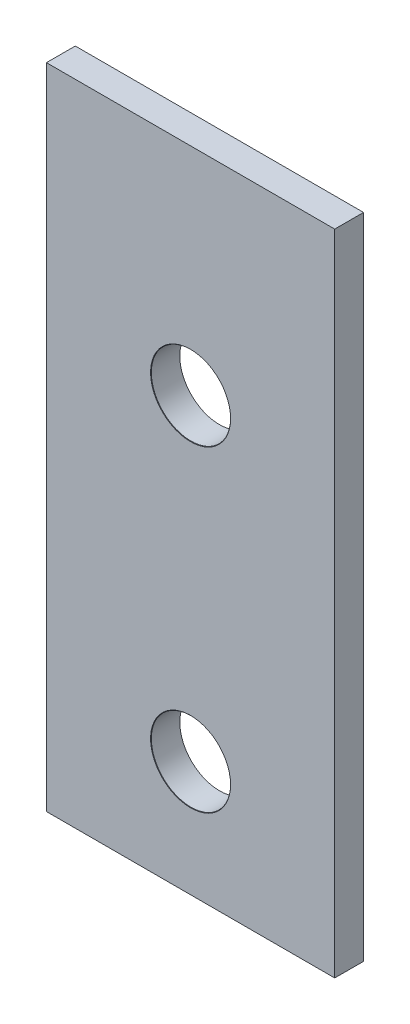
ISO-10303-21;
HEADER;
FILE_DESCRIPTION(('STEP AP214'),'2;1');
FILE_NAME('part.step','',(''),(''),'','','');
FILE_SCHEMA(('AUTOMOTIVE_DESIGN { 1 0 10303 214 1 1 1 1 }'));
ENDSEC;
DATA;
#1=APPLICATION_CONTEXT('core data for automotive mechanical design processes');
#2=APPLICATION_PROTOCOL_DEFINITION('international standard','automotive_design',2000,#1);
#3=PRODUCT_CONTEXT('',#1,'mechanical');
#4=PRODUCT('Part','Part','',(#3));
#5=PRODUCT_RELATED_PRODUCT_CATEGORY('part','',(#4));
#6=PRODUCT_DEFINITION_FORMATION('','',#4);
#7=PRODUCT_DEFINITION_CONTEXT('part definition',#1,'design');
#8=PRODUCT_DEFINITION('design','',#6,#7);
#9=PRODUCT_DEFINITION_SHAPE('','',#8);
#10=(LENGTH_UNIT() NAMED_UNIT(*) SI_UNIT(.MILLI.,.METRE.));
#11=(NAMED_UNIT(*) PLANE_ANGLE_UNIT() SI_UNIT($,.RADIAN.));
#12=(NAMED_UNIT(*) SI_UNIT($,.STERADIAN.) SOLID_ANGLE_UNIT());
#13=UNCERTAINTY_MEASURE_WITH_UNIT(LENGTH_MEASURE(1.E-05),#10,'distance_accuracy_value','');
#14=(GEOMETRIC_REPRESENTATION_CONTEXT(3) GLOBAL_UNCERTAINTY_ASSIGNED_CONTEXT((#13)) GLOBAL_UNIT_ASSIGNED_CONTEXT((#10,
#11,#12)) REPRESENTATION_CONTEXT('',''));
#15=CARTESIAN_POINT('',(0.,0.,0.));
#16=DIRECTION('',(0.,0.,1.));
#17=DIRECTION('',(1.,0.,0.));
#18=AXIS2_PLACEMENT_3D('',#15,#16,#17);
#19=CARTESIAN_POINT('',(0.,0.,2.));
#20=DIRECTION('',(1.,0.,0.));
#21=DIRECTION('',(0.,0.,-1.));
#22=AXIS2_PLACEMENT_3D('',#19,#20,#21);
#23=PLANE('',#22);
#24=DIRECTION('',(0.,-1.,0.));
#25=VECTOR('',#24,1.);
#26=CARTESIAN_POINT('',(0.,0.,0.));
#27=LINE('',#26,#25);
#28=CARTESIAN_POINT('',(0.,45.,0.));
#29=VERTEX_POINT('',#28);
#30=CARTESIAN_POINT('',(0.,0.,0.));
#31=VERTEX_POINT('',#30);
#32=EDGE_CURVE('E97',#29,#31,#27,.T.);
#33=ORIENTED_EDGE('',*,*,#32,.T.);
#34=DIRECTION('',(0.,0.,-1.));
#35=VECTOR('',#34,1.);
#36=CARTESIAN_POINT('',(0.,0.,2.));
#37=LINE('',#36,#35);
#38=CARTESIAN_POINT('',(0.,0.,2.));
#39=VERTEX_POINT('',#38);
#40=EDGE_CURVE('E11',#39,#31,#37,.T.);
#41=ORIENTED_EDGE('',*,*,#40,.F.);
#42=DIRECTION('',(0.,-1.,0.));
#43=VECTOR('',#42,1.);
#44=CARTESIAN_POINT('',(0.,0.,2.));
#45=LINE('',#44,#43);
#46=CARTESIAN_POINT('',(0.,45.,2.));
#47=VERTEX_POINT('',#46);
#48=EDGE_CURVE('E85',#47,#39,#45,.T.);
#49=ORIENTED_EDGE('',*,*,#48,.F.);
#50=DIRECTION('',(0.,0.,-1.));
#51=VECTOR('',#50,1.);
#52=CARTESIAN_POINT('',(0.,45.,2.));
#53=LINE('',#52,#51);
#54=EDGE_CURVE('E93',#47,#29,#53,.T.);
#55=ORIENTED_EDGE('',*,*,#54,.T.);
#56=EDGE_LOOP('',(#33,#41,#49,#55));
#57=FACE_BOUND('',#56,.T.);
#58=ADVANCED_FACE('F34',(#57),#23,.F.);
#59=CARTESIAN_POINT('',(0.,0.,2.));
#60=DIRECTION('',(0.,1.,0.));
#61=DIRECTION('',(0.,0.,1.));
#62=AXIS2_PLACEMENT_3D('',#59,#60,#61);
#63=PLANE('',#62);
#64=DIRECTION('',(1.,0.,0.));
#65=VECTOR('',#64,1.);
#66=CARTESIAN_POINT('',(0.,0.,0.));
#67=LINE('',#66,#65);
#68=CARTESIAN_POINT('',(20.,0.,0.));
#69=VERTEX_POINT('',#68);
#70=EDGE_CURVE('E89',#31,#69,#67,.T.);
#71=ORIENTED_EDGE('',*,*,#70,.T.);
#72=DIRECTION('',(0.,0.,-1.));
#73=VECTOR('',#72,1.);
#74=CARTESIAN_POINT('',(20.,0.,2.));
#75=LINE('',#74,#73);
#76=CARTESIAN_POINT('',(20.,0.,2.));
#77=VERTEX_POINT('',#76);
#78=EDGE_CURVE('E42',#77,#69,#75,.T.);
#79=ORIENTED_EDGE('',*,*,#78,.F.);
#80=DIRECTION('',(1.,0.,0.));
#81=VECTOR('',#80,1.);
#82=CARTESIAN_POINT('',(0.,0.,2.));
#83=LINE('',#82,#81);
#84=EDGE_CURVE('E80',#39,#77,#83,.T.);
#85=ORIENTED_EDGE('',*,*,#84,.F.);
#86=ORIENTED_EDGE('',*,*,#40,.T.);
#87=EDGE_LOOP('',(#71,#79,#85,#86));
#88=FACE_BOUND('',#87,.T.);
#89=ADVANCED_FACE('F88',(#88),#63,.F.);
#90=CARTESIAN_POINT('',(20.,0.,2.));
#91=DIRECTION('',(-1.,0.,0.));
#92=DIRECTION('',(0.,0.,1.));
#93=AXIS2_PLACEMENT_3D('',#90,#91,#92);
#94=PLANE('',#93);
#95=DIRECTION('',(0.,1.,0.));
#96=VECTOR('',#95,1.);
#97=CARTESIAN_POINT('',(20.,0.,0.));
#98=LINE('',#97,#96);
#99=CARTESIAN_POINT('',(20.,45.,0.));
#100=VERTEX_POINT('',#99);
#101=EDGE_CURVE('E67',#69,#100,#98,.T.);
#102=ORIENTED_EDGE('',*,*,#101,.T.);
#103=DIRECTION('',(0.,0.,-1.));
#104=VECTOR('',#103,1.);
#105=CARTESIAN_POINT('',(20.,45.,2.));
#106=LINE('',#105,#104);
#107=CARTESIAN_POINT('',(20.,45.,2.));
#108=VERTEX_POINT('',#107);
#109=EDGE_CURVE('E90',#108,#100,#106,.T.);
#110=ORIENTED_EDGE('',*,*,#109,.F.);
#111=DIRECTION('',(0.,1.,0.));
#112=VECTOR('',#111,1.);
#113=CARTESIAN_POINT('',(20.,0.,2.));
#114=LINE('',#113,#112);
#115=EDGE_CURVE('E83',#77,#108,#114,.T.);
#116=ORIENTED_EDGE('',*,*,#115,.F.);
#117=ORIENTED_EDGE('',*,*,#78,.T.);
#118=EDGE_LOOP('',(#102,#110,#116,#117));
#119=FACE_BOUND('',#118,.T.);
#120=ADVANCED_FACE('F91',(#119),#94,.F.);
#121=CARTESIAN_POINT('',(0.,45.,2.));
#122=DIRECTION('',(0.,-1.,0.));
#123=DIRECTION('',(0.,0.,-1.));
#124=AXIS2_PLACEMENT_3D('',#121,#122,#123);
#125=PLANE('',#124);
#126=DIRECTION('',(-1.,0.,0.));
#127=VECTOR('',#126,1.);
#128=CARTESIAN_POINT('',(0.,45.,0.));
#129=LINE('',#128,#127);
#130=EDGE_CURVE('E73',#100,#29,#129,.T.);
#131=ORIENTED_EDGE('',*,*,#130,.T.);
#132=ORIENTED_EDGE('',*,*,#54,.F.);
#133=DIRECTION('',(-1.,0.,0.));
#134=VECTOR('',#133,1.);
#135=CARTESIAN_POINT('',(0.,45.,2.));
#136=LINE('',#135,#134);
#137=EDGE_CURVE('E50',#108,#47,#136,.T.);
#138=ORIENTED_EDGE('',*,*,#137,.F.);
#139=ORIENTED_EDGE('',*,*,#109,.T.);
#140=EDGE_LOOP('',(#131,#132,#138,#139));
#141=FACE_BOUND('',#140,.T.);
#142=ADVANCED_FACE('F105',(#141),#125,.F.);
#143=CARTESIAN_POINT('',(0.,0.,2.));
#144=DIRECTION('',(0.,0.,-1.));
#145=DIRECTION('',(-1.,0.,0.));
#146=AXIS2_PLACEMENT_3D('',#143,#144,#145);
#147=PLANE('',#146);
#148=CARTESIAN_POINT('',(9.99999999999999,30.,2.));
#149=DIRECTION('',(0.,0.,1.));
#150=DIRECTION('',(1.,0.,0.));
#151=AXIS2_PLACEMENT_3D('',#148,#149,#150);
#152=CIRCLE('',#151,2.775);
#153=CARTESIAN_POINT('',(12.775,30.,2.));
#154=VERTEX_POINT('',#153);
#155=EDGE_CURVE('E125',#154,#154,#152,.T.);
#156=ORIENTED_EDGE('',*,*,#155,.F.);
#157=EDGE_LOOP('',(#156));
#158=FACE_BOUND('',#157,.T.);
#159=CARTESIAN_POINT('',(10.,8.,2.));
#160=DIRECTION('',(0.,0.,1.));
#161=DIRECTION('',(1.,0.,0.));
#162=AXIS2_PLACEMENT_3D('',#159,#160,#161);
#163=CIRCLE('',#162,2.775);
#164=CARTESIAN_POINT('',(12.775,8.,2.));
#165=VERTEX_POINT('',#164);
#166=EDGE_CURVE('E116',#165,#165,#163,.T.);
#167=ORIENTED_EDGE('',*,*,#166,.F.);
#168=EDGE_LOOP('',(#167));
#169=FACE_BOUND('',#168,.T.);
#170=ORIENTED_EDGE('',*,*,#48,.T.);
#171=ORIENTED_EDGE('',*,*,#84,.T.);
#172=ORIENTED_EDGE('',*,*,#115,.T.);
#173=ORIENTED_EDGE('',*,*,#137,.T.);
#174=EDGE_LOOP('',(#170,#171,#172,#173));
#175=FACE_BOUND('',#174,.T.);
#176=ADVANCED_FACE('F81',(#158,#169,#175),#147,.F.);
#177=CARTESIAN_POINT('',(0.,0.,0.));
#178=DIRECTION('',(0.,0.,-1.));
#179=DIRECTION('',(-1.,0.,0.));
#180=AXIS2_PLACEMENT_3D('',#177,#178,#179);
#181=PLANE('',#180);
#182=CARTESIAN_POINT('',(9.99999999999999,30.,0.));
#183=DIRECTION('',(0.,0.,1.));
#184=DIRECTION('',(1.,0.,0.));
#185=AXIS2_PLACEMENT_3D('',#182,#183,#184);
#186=CIRCLE('',#185,2.75);
#187=CARTESIAN_POINT('',(12.75,30.,0.));
#188=VERTEX_POINT('',#187);
#189=EDGE_CURVE('E119',#188,#188,#186,.T.);
#190=ORIENTED_EDGE('',*,*,#189,.T.);
#191=EDGE_LOOP('',(#190));
#192=FACE_BOUND('',#191,.T.);
#193=CARTESIAN_POINT('',(10.,8.,0.));
#194=DIRECTION('',(0.,0.,1.));
#195=DIRECTION('',(1.,0.,0.));
#196=AXIS2_PLACEMENT_3D('',#193,#194,#195);
#197=CIRCLE('',#196,2.75);
#198=CARTESIAN_POINT('',(12.75,8.,0.));
#199=VERTEX_POINT('',#198);
#200=EDGE_CURVE('E100',#199,#199,#197,.T.);
#201=ORIENTED_EDGE('',*,*,#200,.T.);
#202=EDGE_LOOP('',(#201));
#203=FACE_BOUND('',#202,.T.);
#204=ORIENTED_EDGE('',*,*,#32,.F.);
#205=ORIENTED_EDGE('',*,*,#130,.F.);
#206=ORIENTED_EDGE('',*,*,#101,.F.);
#207=ORIENTED_EDGE('',*,*,#70,.F.);
#208=EDGE_LOOP('',(#204,#205,#206,#207));
#209=FACE_BOUND('',#208,.T.);
#210=ADVANCED_FACE('F108',(#192,#203,#209),#181,.T.);
#211=CARTESIAN_POINT('',(10.,8.,2.));
#212=DIRECTION('',(0.,0.,1.));
#213=DIRECTION('',(1.,0.,0.));
#214=AXIS2_PLACEMENT_3D('',#211,#212,#213);
#215=CYLINDRICAL_SURFACE('',#214,2.75);
#216=ORIENTED_EDGE('',*,*,#200,.F.);
#217=EDGE_LOOP('',(#216));
#218=FACE_BOUND('',#217,.T.);
#219=CARTESIAN_POINT('',(10.,8.,1.975));
#220=DIRECTION('',(0.,0.,1.));
#221=DIRECTION('',(1.,0.,0.));
#222=AXIS2_PLACEMENT_3D('',#219,#220,#221);
#223=CIRCLE('',#222,2.75);
#224=CARTESIAN_POINT('',(12.75,8.,1.975));
#225=VERTEX_POINT('',#224);
#226=EDGE_CURVE('E113',#225,#225,#223,.T.);
#227=ORIENTED_EDGE('',*,*,#226,.T.);
#228=EDGE_LOOP('',(#227));
#229=FACE_BOUND('',#228,.T.);
#230=ADVANCED_FACE('F139',(#218,#229),#215,.F.);
#231=CARTESIAN_POINT('',(10.,8.,2.));
#232=DIRECTION('',(0.,0.,1.));
#233=DIRECTION('',(1.,0.,0.));
#234=AXIS2_PLACEMENT_3D('',#231,#232,#233);
#235=CONICAL_SURFACE('',#234,2.775,0.785398163397379);
#236=ORIENTED_EDGE('',*,*,#226,.F.);
#237=EDGE_LOOP('',(#236));
#238=FACE_BOUND('',#237,.T.);
#239=ORIENTED_EDGE('',*,*,#166,.T.);
#240=EDGE_LOOP('',(#239));
#241=FACE_BOUND('',#240,.T.);
#242=ADVANCED_FACE('F136',(#238,#241),#235,.F.);
#243=CARTESIAN_POINT('',(9.99999999999999,30.,2.));
#244=DIRECTION('',(0.,0.,1.));
#245=DIRECTION('',(1.,0.,0.));
#246=AXIS2_PLACEMENT_3D('',#243,#244,#245);
#247=CYLINDRICAL_SURFACE('',#246,2.75);
#248=ORIENTED_EDGE('',*,*,#189,.F.);
#249=EDGE_LOOP('',(#248));
#250=FACE_BOUND('',#249,.T.);
#251=CARTESIAN_POINT('',(9.99999999999999,30.,1.975));
#252=DIRECTION('',(0.,0.,1.));
#253=DIRECTION('',(1.,0.,0.));
#254=AXIS2_PLACEMENT_3D('',#251,#252,#253);
#255=CIRCLE('',#254,2.75);
#256=CARTESIAN_POINT('',(12.75,30.,1.975));
#257=VERTEX_POINT('',#256);
#258=EDGE_CURVE('E122',#257,#257,#255,.T.);
#259=ORIENTED_EDGE('',*,*,#258,.T.);
#260=EDGE_LOOP('',(#259));
#261=FACE_BOUND('',#260,.T.);
#262=ADVANCED_FACE('F138',(#250,#261),#247,.F.);
#263=CARTESIAN_POINT('',(9.99999999999999,30.,2.));
#264=DIRECTION('',(0.,0.,1.));
#265=DIRECTION('',(1.,0.,0.));
#266=AXIS2_PLACEMENT_3D('',#263,#264,#265);
#267=CONICAL_SURFACE('',#266,2.775,0.785398163397379);
#268=ORIENTED_EDGE('',*,*,#258,.F.);
#269=EDGE_LOOP('',(#268));
#270=FACE_BOUND('',#269,.T.);
#271=ORIENTED_EDGE('',*,*,#155,.T.);
#272=EDGE_LOOP('',(#271));
#273=FACE_BOUND('',#272,.T.);
#274=ADVANCED_FACE('F129',(#270,#273),#267,.F.);
#275=CLOSED_SHELL('',(#58,#89,#120,#142,#176,#210,#230,#242,#262,#274));
#276=MANIFOLD_SOLID_BREP('B2',#275);
#277=ADVANCED_BREP_SHAPE_REPRESENTATION('',(#18,#276),#14);
#278=SHAPE_DEFINITION_REPRESENTATION(#9,#277);
ENDSEC;
END-ISO-10303-21;
